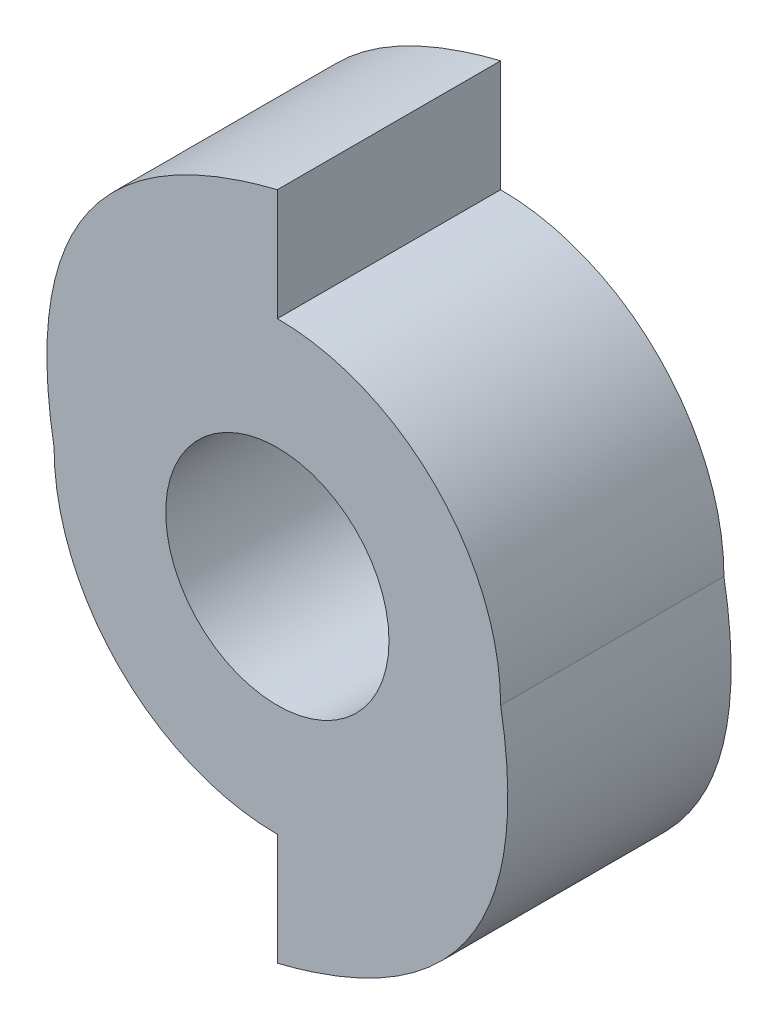
ISO-10303-21;
HEADER;
FILE_DESCRIPTION(('STEP AP214'),'2;1');
FILE_NAME('part.step','',(''),(''),'','','');
FILE_SCHEMA(('AUTOMOTIVE_DESIGN { 1 0 10303 214 1 1 1 1 }'));
ENDSEC;
DATA;
#1=APPLICATION_CONTEXT('core data for automotive mechanical design processes');
#2=APPLICATION_PROTOCOL_DEFINITION('international standard','automotive_design',2000,#1);
#3=PRODUCT_CONTEXT('',#1,'mechanical');
#4=PRODUCT('Part','Part','',(#3));
#5=PRODUCT_RELATED_PRODUCT_CATEGORY('part','',(#4));
#6=PRODUCT_DEFINITION_FORMATION('','',#4);
#7=PRODUCT_DEFINITION_CONTEXT('part definition',#1,'design');
#8=PRODUCT_DEFINITION('design','',#6,#7);
#9=PRODUCT_DEFINITION_SHAPE('','',#8);
#10=(LENGTH_UNIT() NAMED_UNIT(*) SI_UNIT(.MILLI.,.METRE.));
#11=(NAMED_UNIT(*) PLANE_ANGLE_UNIT() SI_UNIT($,.RADIAN.));
#12=(NAMED_UNIT(*) SI_UNIT($,.STERADIAN.) SOLID_ANGLE_UNIT());
#13=UNCERTAINTY_MEASURE_WITH_UNIT(LENGTH_MEASURE(1.E-05),#10,'distance_accuracy_value','');
#14=(GEOMETRIC_REPRESENTATION_CONTEXT(3) GLOBAL_UNCERTAINTY_ASSIGNED_CONTEXT((#13)) GLOBAL_UNIT_ASSIGNED_CONTEXT((#10,
#11,#12)) REPRESENTATION_CONTEXT('',''));
#15=CARTESIAN_POINT('',(0.,0.,0.));
#16=DIRECTION('',(0.,0.,1.));
#17=DIRECTION('',(1.,0.,0.));
#18=AXIS2_PLACEMENT_3D('',#15,#16,#17);
#19=CARTESIAN_POINT('',(844744.611075795,-535294.892217047,6.35));
#20=CARTESIAN_POINT('',(-846426.920635598,532390.022154589,6.35));
#21=CARTESIAN_POINT('',(848467.50359813,-529375.072745995,6.35));
#22=B_SPLINE_CURVE_WITH_KNOTS('',2,(#19,#20,#21),.UNSPECIFIED.,.F.,.F.,(3,3),(0.,1.),.UNSPECIFIED.);
#23=DIRECTION('',(0.,0.,-1.));
#24=VECTOR('',#23,1.);
#25=SURFACE_OF_LINEAR_EXTRUSION('',#22,#24);
#26=CARTESIAN_POINT('',(844744.611075795,-535294.892217047,0.));
#27=CARTESIAN_POINT('',(-846426.920635598,532390.022154589,0.));
#28=CARTESIAN_POINT('',(848467.50359813,-529375.072745995,0.));
#29=B_SPLINE_CURVE_WITH_KNOTS('',2,(#26,#27,#28),.UNSPECIFIED.,.F.,.F.,(3,3),(0.,1.),.UNSPECIFIED.);
#30=CARTESIAN_POINT('',(88.7486109122551,21.4683786908351,0.));
#31=VERTEX_POINT('',#30);
#32=CARTESIAN_POINT('',(95.0986109122551,30.9933786908351,0.));
#33=VERTEX_POINT('',#32);
#34=EDGE_CURVE('E149',#31,#33,#29,.T.);
#35=ORIENTED_EDGE('',*,*,#34,.F.);
#36=DIRECTION('',(0.,0.,-1.));
#37=VECTOR('',#36,1.);
#38=CARTESIAN_POINT('',(88.7486109122551,21.4683786908351,6.35));
#39=LINE('',#38,#37);
#40=CARTESIAN_POINT('',(88.7486109122551,21.4683786908351,6.35));
#41=VERTEX_POINT('',#40);
#42=EDGE_CURVE('E12',#41,#31,#39,.T.);
#43=ORIENTED_EDGE('',*,*,#42,.F.);
#44=CARTESIAN_POINT('',(95.0986109122551,30.9933786908351,6.35));
#45=VERTEX_POINT('',#44);
#46=EDGE_CURVE('E176',#41,#45,#22,.T.);
#47=ORIENTED_EDGE('',*,*,#46,.T.);
#48=DIRECTION('',(0.,0.,-1.));
#49=VECTOR('',#48,1.);
#50=CARTESIAN_POINT('',(95.0986109122551,30.9933786908351,6.35));
#51=LINE('',#50,#49);
#52=EDGE_CURVE('E56',#45,#33,#51,.T.);
#53=ORIENTED_EDGE('',*,*,#52,.T.);
#54=EDGE_LOOP('',(#35,#43,#47,#53));
#55=FACE_BOUND('',#54,.T.);
#56=ADVANCED_FACE('F39',(#55),#25,.T.);
#57=CARTESIAN_POINT('',(95.0986109122551,21.4683786908351,6.35));
#58=DIRECTION('',(0.,0.,-1.));
#59=DIRECTION('',(-1.,0.,0.));
#60=AXIS2_PLACEMENT_3D('',#57,#58,#59);
#61=CYLINDRICAL_SURFACE('',#60,6.35);
#62=CARTESIAN_POINT('',(95.0986109122551,21.4683786908351,0.));
#63=DIRECTION('',(0.,0.,1.));
#64=DIRECTION('',(1.,0.,0.));
#65=AXIS2_PLACEMENT_3D('',#62,#63,#64);
#66=CIRCLE('',#65,6.35);
#67=CARTESIAN_POINT('',(95.0986109122533,15.1183786908351,0.));
#68=VERTEX_POINT('',#67);
#69=EDGE_CURVE('E153',#31,#68,#66,.T.);
#70=ORIENTED_EDGE('',*,*,#69,.T.);
#71=DIRECTION('',(0.,0.,-1.));
#72=VECTOR('',#71,1.);
#73=CARTESIAN_POINT('',(95.0986109122533,15.1183786908351,6.35));
#74=LINE('',#73,#72);
#75=CARTESIAN_POINT('',(95.0986109122533,15.1183786908351,6.35));
#76=VERTEX_POINT('',#75);
#77=EDGE_CURVE('E48',#76,#68,#74,.T.);
#78=ORIENTED_EDGE('',*,*,#77,.F.);
#79=CARTESIAN_POINT('',(95.0986109122551,21.4683786908351,6.35));
#80=DIRECTION('',(0.,0.,1.));
#81=DIRECTION('',(1.,0.,0.));
#82=AXIS2_PLACEMENT_3D('',#79,#80,#81);
#83=CIRCLE('',#82,6.35);
#84=EDGE_CURVE('E122',#41,#76,#83,.T.);
#85=ORIENTED_EDGE('',*,*,#84,.F.);
#86=ORIENTED_EDGE('',*,*,#42,.T.);
#87=EDGE_LOOP('',(#70,#78,#85,#86));
#88=FACE_BOUND('',#87,.T.);
#89=ADVANCED_FACE('F185',(#88),#61,.T.);
#90=CARTESIAN_POINT('',(95.0986109122533,0.,6.35));
#91=DIRECTION('',(-1.,0.,0.));
#92=DIRECTION('',(0.,0.,1.));
#93=AXIS2_PLACEMENT_3D('',#90,#91,#92);
#94=PLANE('',#93);
#95=DIRECTION('',(0.,1.,0.));
#96=VECTOR('',#95,1.);
#97=CARTESIAN_POINT('',(95.0986109122533,0.,0.));
#98=LINE('',#97,#96);
#99=CARTESIAN_POINT('',(95.0986109122533,11.9433786908351,0.));
#100=VERTEX_POINT('',#99);
#101=EDGE_CURVE('E159',#100,#68,#98,.T.);
#102=ORIENTED_EDGE('',*,*,#101,.F.);
#103=DIRECTION('',(0.,0.,-1.));
#104=VECTOR('',#103,1.);
#105=CARTESIAN_POINT('',(95.0986109122533,11.9433786908351,6.35));
#106=LINE('',#105,#104);
#107=CARTESIAN_POINT('',(95.0986109122533,11.9433786908351,6.35));
#108=VERTEX_POINT('',#107);
#109=EDGE_CURVE('E104',#108,#100,#106,.T.);
#110=ORIENTED_EDGE('',*,*,#109,.F.);
#111=DIRECTION('',(0.,1.,0.));
#112=VECTOR('',#111,1.);
#113=CARTESIAN_POINT('',(95.0986109122533,0.,6.35));
#114=LINE('',#113,#112);
#115=EDGE_CURVE('E118',#108,#76,#114,.T.);
#116=ORIENTED_EDGE('',*,*,#115,.T.);
#117=ORIENTED_EDGE('',*,*,#77,.T.);
#118=EDGE_LOOP('',(#102,#110,#116,#117));
#119=FACE_BOUND('',#118,.T.);
#120=ADVANCED_FACE('F182',(#119),#94,.T.);
#121=CARTESIAN_POINT('',(-844554.413853922,535337.828974504,6.35));
#122=CARTESIAN_POINT('',(846617.117857374,-532347.085397283,6.35));
#123=CARTESIAN_POINT('',(-848277.306376258,529418.009503452,6.35));
#124=B_SPLINE_CURVE_WITH_KNOTS('',2,(#121,#122,#123),.UNSPECIFIED.,.F.,.F.,(3,3),(0.,1.),.UNSPECIFIED.);
#125=DIRECTION('',(0.,0.,-1.));
#126=VECTOR('',#125,1.);
#127=SURFACE_OF_LINEAR_EXTRUSION('',#124,#126);
#128=CARTESIAN_POINT('',(-844554.413853922,535337.828974504,0.));
#129=CARTESIAN_POINT('',(846617.117857374,-532347.085397283,0.));
#130=CARTESIAN_POINT('',(-848277.306376258,529418.009503452,0.));
#131=B_SPLINE_CURVE_WITH_KNOTS('',2,(#128,#129,#130),.UNSPECIFIED.,.F.,.F.,(3,3),(0.,1.),.UNSPECIFIED.);
#132=CARTESIAN_POINT('',(101.448610912255,21.4683786908351,0.));
#133=VERTEX_POINT('',#132);
#134=EDGE_CURVE('E101',#133,#100,#131,.T.);
#135=ORIENTED_EDGE('',*,*,#134,.F.);
#136=DIRECTION('',(0.,0.,-1.));
#137=VECTOR('',#136,1.);
#138=CARTESIAN_POINT('',(101.448610912255,21.4683786908351,6.35));
#139=LINE('',#138,#137);
#140=CARTESIAN_POINT('',(101.448610912255,21.4683786908351,6.35));
#141=VERTEX_POINT('',#140);
#142=EDGE_CURVE('E95',#141,#133,#139,.T.);
#143=ORIENTED_EDGE('',*,*,#142,.F.);
#144=EDGE_CURVE('E99',#141,#108,#124,.T.);
#145=ORIENTED_EDGE('',*,*,#144,.T.);
#146=ORIENTED_EDGE('',*,*,#109,.T.);
#147=EDGE_LOOP('',(#135,#143,#145,#146));
#148=FACE_BOUND('',#147,.T.);
#149=ADVANCED_FACE('F97',(#148),#127,.T.);
#150=CARTESIAN_POINT('',(95.0986109122551,21.4683786908351,6.35));
#151=DIRECTION('',(0.,0.,-1.));
#152=DIRECTION('',(-1.,0.,0.));
#153=AXIS2_PLACEMENT_3D('',#150,#151,#152);
#154=CYLINDRICAL_SURFACE('',#153,6.34999999999999);
#155=CARTESIAN_POINT('',(95.0986109122551,21.4683786908351,0.));
#156=DIRECTION('',(0.,0.,1.));
#157=DIRECTION('',(1.,0.,0.));
#158=AXIS2_PLACEMENT_3D('',#155,#156,#157);
#159=CIRCLE('',#158,6.34999999999999);
#160=CARTESIAN_POINT('',(95.0986109122551,27.8183786908351,0.));
#161=VERTEX_POINT('',#160);
#162=EDGE_CURVE('E165',#133,#161,#159,.T.);
#163=ORIENTED_EDGE('',*,*,#162,.T.);
#164=DIRECTION('',(0.,0.,-1.));
#165=VECTOR('',#164,1.);
#166=CARTESIAN_POINT('',(95.0986109122551,27.8183786908351,6.35));
#167=LINE('',#166,#165);
#168=CARTESIAN_POINT('',(95.0986109122551,27.8183786908351,6.35));
#169=VERTEX_POINT('',#168);
#170=EDGE_CURVE('E76',#169,#161,#167,.T.);
#171=ORIENTED_EDGE('',*,*,#170,.F.);
#172=CARTESIAN_POINT('',(95.0986109122551,21.4683786908351,6.35));
#173=DIRECTION('',(0.,0.,1.));
#174=DIRECTION('',(1.,0.,0.));
#175=AXIS2_PLACEMENT_3D('',#172,#173,#174);
#176=CIRCLE('',#175,6.34999999999999);
#177=EDGE_CURVE('E106',#141,#169,#176,.T.);
#178=ORIENTED_EDGE('',*,*,#177,.F.);
#179=ORIENTED_EDGE('',*,*,#142,.T.);
#180=EDGE_LOOP('',(#163,#171,#178,#179));
#181=FACE_BOUND('',#180,.T.);
#182=ADVANCED_FACE('F107',(#181),#154,.T.);
#183=CARTESIAN_POINT('',(95.0986109122549,-4.15671919073442E-13,6.35));
#184=DIRECTION('',(1.,0.,0.));
#185=DIRECTION('',(0.,1.,0.));
#186=AXIS2_PLACEMENT_3D('',#183,#184,#185);
#187=PLANE('',#186);
#188=DIRECTION('',(0.,-1.,0.));
#189=VECTOR('',#188,1.);
#190=CARTESIAN_POINT('',(95.0986109122549,-4.15671919073442E-13,0.));
#191=LINE('',#190,#189);
#192=EDGE_CURVE('E170',#33,#161,#191,.T.);
#193=ORIENTED_EDGE('',*,*,#192,.F.);
#194=ORIENTED_EDGE('',*,*,#52,.F.);
#195=DIRECTION('',(0.,-1.,0.));
#196=VECTOR('',#195,1.);
#197=CARTESIAN_POINT('',(95.0986109122549,-4.15671919073442E-13,6.35));
#198=LINE('',#197,#196);
#199=EDGE_CURVE('E111',#45,#169,#198,.T.);
#200=ORIENTED_EDGE('',*,*,#199,.T.);
#201=ORIENTED_EDGE('',*,*,#170,.T.);
#202=EDGE_LOOP('',(#193,#194,#200,#201));
#203=FACE_BOUND('',#202,.T.);
#204=ADVANCED_FACE('F189',(#203),#187,.T.);
#205=CARTESIAN_POINT('',(95.0986109122551,21.4683786908351,6.35));
#206=DIRECTION('',(0.,0.,-1.));
#207=DIRECTION('',(-1.,0.,0.));
#208=AXIS2_PLACEMENT_3D('',#205,#206,#207);
#209=CYLINDRICAL_SURFACE('',#208,3.175);
#210=CARTESIAN_POINT('',(95.0986109122551,21.4683786908351,6.35));
#211=DIRECTION('',(0.,0.,1.));
#212=DIRECTION('',(1.,0.,0.));
#213=AXIS2_PLACEMENT_3D('',#210,#211,#212);
#214=CIRCLE('',#213,3.175);
#215=CARTESIAN_POINT('',(98.2736109122551,21.4683786908351,6.35));
#216=VERTEX_POINT('',#215);
#217=EDGE_CURVE('E144',#216,#216,#214,.T.);
#218=ORIENTED_EDGE('',*,*,#217,.T.);
#219=EDGE_LOOP('',(#218));
#220=FACE_BOUND('',#219,.T.);
#221=CARTESIAN_POINT('',(95.0986109122551,21.4683786908351,0.));
#222=DIRECTION('',(0.,0.,1.));
#223=DIRECTION('',(1.,0.,0.));
#224=AXIS2_PLACEMENT_3D('',#221,#222,#223);
#225=CIRCLE('',#224,3.175);
#226=CARTESIAN_POINT('',(98.2736109122551,21.4683786908351,0.));
#227=VERTEX_POINT('',#226);
#228=EDGE_CURVE('E173',#227,#227,#225,.T.);
#229=ORIENTED_EDGE('',*,*,#228,.F.);
#230=EDGE_LOOP('',(#229));
#231=FACE_BOUND('',#230,.T.);
#232=ADVANCED_FACE('F191',(#220,#231),#209,.F.);
#233=CARTESIAN_POINT('',(0.,0.,6.35));
#234=DIRECTION('',(0.,0.,1.));
#235=DIRECTION('',(1.,0.,0.));
#236=AXIS2_PLACEMENT_3D('',#233,#234,#235);
#237=PLANE('',#236);
#238=ORIENTED_EDGE('',*,*,#46,.F.);
#239=ORIENTED_EDGE('',*,*,#84,.T.);
#240=ORIENTED_EDGE('',*,*,#115,.F.);
#241=ORIENTED_EDGE('',*,*,#144,.F.);
#242=ORIENTED_EDGE('',*,*,#177,.T.);
#243=ORIENTED_EDGE('',*,*,#199,.F.);
#244=EDGE_LOOP('',(#238,#239,#240,#241,#242,#243));
#245=FACE_BOUND('',#244,.T.);
#246=ORIENTED_EDGE('',*,*,#217,.F.);
#247=EDGE_LOOP('',(#246));
#248=FACE_BOUND('',#247,.T.);
#249=ADVANCED_FACE('F115',(#245,#248),#237,.T.);
#250=CARTESIAN_POINT('',(0.,0.,0.));
#251=DIRECTION('',(0.,0.,1.));
#252=DIRECTION('',(1.,0.,0.));
#253=AXIS2_PLACEMENT_3D('',#250,#251,#252);
#254=PLANE('',#253);
#255=ORIENTED_EDGE('',*,*,#34,.T.);
#256=ORIENTED_EDGE('',*,*,#192,.T.);
#257=ORIENTED_EDGE('',*,*,#162,.F.);
#258=ORIENTED_EDGE('',*,*,#134,.T.);
#259=ORIENTED_EDGE('',*,*,#101,.T.);
#260=ORIENTED_EDGE('',*,*,#69,.F.);
#261=EDGE_LOOP('',(#255,#256,#257,#258,#259,#260));
#262=FACE_BOUND('',#261,.T.);
#263=ORIENTED_EDGE('',*,*,#228,.T.);
#264=EDGE_LOOP('',(#263));
#265=FACE_BOUND('',#264,.T.);
#266=ADVANCED_FACE('F187',(#262,#265),#254,.F.);
#267=CLOSED_SHELL('',(#56,#89,#120,#149,#182,#204,#232,#249,#266));
#268=MANIFOLD_SOLID_BREP('B2',#267);
#269=ADVANCED_BREP_SHAPE_REPRESENTATION('',(#18,#268),#14);
#270=SHAPE_DEFINITION_REPRESENTATION(#9,#269);
ENDSEC;
END-ISO-10303-21;
